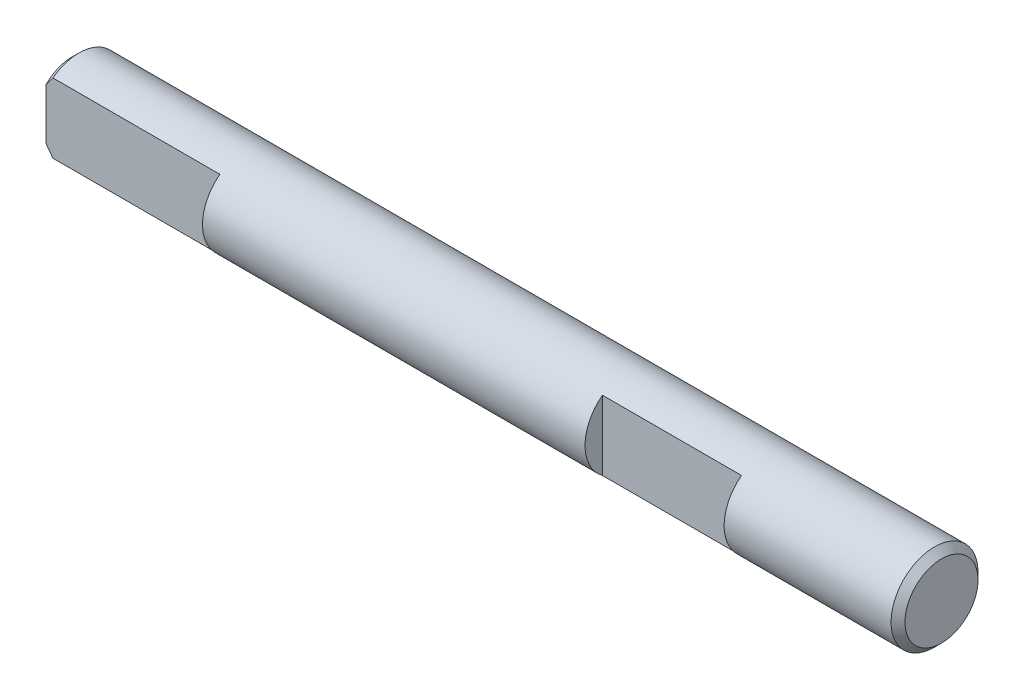
ISO-10303-21;
HEADER;
FILE_DESCRIPTION(('STEP AP214'),'2;1');
FILE_NAME('part.step','',(''),(''),'','','');
FILE_SCHEMA(('AUTOMOTIVE_DESIGN { 1 0 10303 214 1 1 1 1 }'));
ENDSEC;
DATA;
#1=APPLICATION_CONTEXT('core data for automotive mechanical design processes');
#2=APPLICATION_PROTOCOL_DEFINITION('international standard','automotive_design',2000,#1);
#3=PRODUCT_CONTEXT('',#1,'mechanical');
#4=PRODUCT('Part','Part','',(#3));
#5=PRODUCT_RELATED_PRODUCT_CATEGORY('part','',(#4));
#6=PRODUCT_DEFINITION_FORMATION('','',#4);
#7=PRODUCT_DEFINITION_CONTEXT('part definition',#1,'design');
#8=PRODUCT_DEFINITION('design','',#6,#7);
#9=PRODUCT_DEFINITION_SHAPE('','',#8);
#10=(LENGTH_UNIT() NAMED_UNIT(*) SI_UNIT(.MILLI.,.METRE.));
#11=(NAMED_UNIT(*) PLANE_ANGLE_UNIT() SI_UNIT($,.RADIAN.));
#12=(NAMED_UNIT(*) SI_UNIT($,.STERADIAN.) SOLID_ANGLE_UNIT());
#13=UNCERTAINTY_MEASURE_WITH_UNIT(LENGTH_MEASURE(1.E-05),#10,'distance_accuracy_value','');
#14=(GEOMETRIC_REPRESENTATION_CONTEXT(3) GLOBAL_UNCERTAINTY_ASSIGNED_CONTEXT((#13)) GLOBAL_UNIT_ASSIGNED_CONTEXT((#10,
#11,#12)) REPRESENTATION_CONTEXT('',''));
#15=CARTESIAN_POINT('',(0.,0.,0.));
#16=DIRECTION('',(0.,0.,1.));
#17=DIRECTION('',(1.,0.,0.));
#18=AXIS2_PLACEMENT_3D('',#15,#16,#17);
#19=CARTESIAN_POINT('',(-35.499005006743,-29.8491114358384,-79.6629999999964));
#20=DIRECTION('',(0.,0.,-1.));
#21=DIRECTION('',(-1.,0.,0.));
#22=AXIS2_PLACEMENT_3D('',#19,#20,#21);
#23=PLANE('',#22);
#24=CARTESIAN_POINT('',(-37.4990050067429,-28.3794175901685,-79.6629999999963));
#25=CARTESIAN_POINT('',(-37.3295728999299,-28.1373213023221,-79.6629999999964));
#26=CARTESIAN_POINT('',(-37.0990050067429,-27.8491114358384,-79.6629999999964));
#27=(BOUNDED_CURVE() B_SPLINE_CURVE(2,(#24,#25,#26),.UNSPECIFIED.,.F.,
.F.) B_SPLINE_CURVE_WITH_KNOTS((3,3),(0.,0.159512079210779),
.UNSPECIFIED.) CURVE() GEOMETRIC_REPRESENTATION_ITEM() RATIONAL_B_SPLINE_CURVE((1.,
1.05397828201192,1.09610632234515)) REPRESENTATION_ITEM(''));
#28=CARTESIAN_POINT('',(-37.4990050067429,-28.3794175901685,-79.6629999999964));
#29=VERTEX_POINT('',#28);
#30=CARTESIAN_POINT('',(-37.0990050067429,-27.8491114358384,-79.6629999999964));
#31=VERTEX_POINT('',#30);
#32=EDGE_CURVE('E117',#29,#31,#27,.T.);
#33=ORIENTED_EDGE('',*,*,#32,.F.);
#34=DIRECTION('',(0.,1.,0.));
#35=VECTOR('',#34,1.);
#36=CARTESIAN_POINT('',(-37.4990050067429,-29.8491114358384,-79.6629999999964));
#37=LINE('',#36,#35);
#38=CARTESIAN_POINT('',(-37.4990050067429,-31.3188052815083,-79.6629999999964));
#39=VERTEX_POINT('',#38);
#40=EDGE_CURVE('E37',#39,#29,#37,.T.);
#41=ORIENTED_EDGE('',*,*,#40,.F.);
#42=CARTESIAN_POINT('',(-37.0990050067429,-31.8491114358384,-79.6629999999965));
#43=CARTESIAN_POINT('',(-37.3295728999299,-31.5609015693547,-79.6629999999964));
#44=CARTESIAN_POINT('',(-37.4990050067429,-31.3188052815083,-79.6629999999963));
#45=(BOUNDED_CURVE() B_SPLINE_CURVE(2,(#42,#43,#44),.UNSPECIFIED.,.F.,
.F.) B_SPLINE_CURVE_WITH_KNOTS((3,3),(1.29365456994341,1.4531666491542),
.UNSPECIFIED.) CURVE() GEOMETRIC_REPRESENTATION_ITEM() RATIONAL_B_SPLINE_CURVE((1.09610632234512,
1.05397828201191,1.)) REPRESENTATION_ITEM(''));
#46=CARTESIAN_POINT('',(-37.0990050067429,-31.8491114358384,-79.6629999999964));
#47=VERTEX_POINT('',#46);
#48=EDGE_CURVE('E100',#47,#39,#45,.T.);
#49=ORIENTED_EDGE('',*,*,#48,.F.);
#50=DIRECTION('',(-1.,0.,0.));
#51=VECTOR('',#50,1.);
#52=CARTESIAN_POINT('',(10.5010000000472,-31.8491114358384,-79.6629999999964));
#53=LINE('',#52,#51);
#54=CARTESIAN_POINT('',(-27.499005006743,-31.8491114358384,-79.6629999999964));
#55=VERTEX_POINT('',#54);
#56=EDGE_CURVE('E115',#55,#47,#53,.T.);
#57=ORIENTED_EDGE('',*,*,#56,.F.);
#58=DIRECTION('',(0.,1.,0.));
#59=VECTOR('',#58,1.);
#60=CARTESIAN_POINT('',(-27.499005006743,-29.8491114358384,-79.6629999999964));
#61=LINE('',#60,#59);
#62=CARTESIAN_POINT('',(-27.499005006743,-27.8491114358384,-79.6629999999964));
#63=VERTEX_POINT('',#62);
#64=EDGE_CURVE('E11',#55,#63,#61,.T.);
#65=ORIENTED_EDGE('',*,*,#64,.T.);
#66=DIRECTION('',(1.,0.,0.));
#67=VECTOR('',#66,1.);
#68=CARTESIAN_POINT('',(10.5010000000472,-27.8491114358384,-79.6629999999964));
#69=LINE('',#68,#67);
#70=EDGE_CURVE('E151',#31,#63,#69,.T.);
#71=ORIENTED_EDGE('',*,*,#70,.F.);
#72=EDGE_LOOP('',(#33,#41,#49,#57,#65,#71));
#73=FACE_BOUND('',#72,.T.);
#74=ADVANCED_FACE('F16',(#73),#23,.F.);
#75=CARTESIAN_POINT('',(-27.499005006743,-29.8491114358384,-79.6629999999964));
#76=DIRECTION('',(1.,0.,0.));
#77=DIRECTION('',(0.,0.,-1.));
#78=AXIS2_PLACEMENT_3D('',#75,#76,#77);
#79=PLANE('',#78);
#80=CARTESIAN_POINT('',(-27.499005006743,-29.8491114358384,-81.1629999999964));
#81=DIRECTION('',(1.,0.,0.));
#82=DIRECTION('',(0.,1.,0.));
#83=AXIS2_PLACEMENT_3D('',#80,#81,#82);
#84=CIRCLE('',#83,2.5);
#85=EDGE_CURVE('E148',#63,#55,#84,.T.);
#86=ORIENTED_EDGE('',*,*,#85,.F.);
#87=ORIENTED_EDGE('',*,*,#64,.F.);
#88=EDGE_LOOP('',(#86,#87));
#89=FACE_BOUND('',#88,.T.);
#90=ADVANCED_FACE('F199',(#89),#79,.F.);
#91=CARTESIAN_POINT('',(-5.49900029797599,-29.8491114358384,-79.6629999999964));
#92=DIRECTION('',(0.,0.,-1.));
#93=DIRECTION('',(-1.,0.,0.));
#94=AXIS2_PLACEMENT_3D('',#91,#92,#93);
#95=PLANE('',#94);
#96=DIRECTION('',(-1.,0.,0.));
#97=VECTOR('',#96,1.);
#98=CARTESIAN_POINT('',(10.5010000000472,-31.8491114358384,-79.6629999999964));
#99=LINE('',#98,#97);
#100=CARTESIAN_POINT('',(2.5009998212333,-31.8491114358384,-79.6629999999964));
#101=VERTEX_POINT('',#100);
#102=CARTESIAN_POINT('',(-5.49900029797599,-31.8491114358384,-79.6629999999964));
#103=VERTEX_POINT('',#102);
#104=EDGE_CURVE('E104',#101,#103,#99,.T.);
#105=ORIENTED_EDGE('',*,*,#104,.F.);
#106=DIRECTION('',(0.,-1.,0.));
#107=VECTOR('',#106,1.);
#108=CARTESIAN_POINT('',(2.5009998212333,-29.8491114358384,-79.6629999999964));
#109=LINE('',#108,#107);
#110=CARTESIAN_POINT('',(2.5009998212333,-27.8491114358384,-79.6629999999964));
#111=VERTEX_POINT('',#110);
#112=EDGE_CURVE('E26',#111,#101,#109,.T.);
#113=ORIENTED_EDGE('',*,*,#112,.F.);
#114=DIRECTION('',(1.,0.,0.));
#115=VECTOR('',#114,1.);
#116=CARTESIAN_POINT('',(10.5010000000472,-27.8491114358384,-79.6629999999964));
#117=LINE('',#116,#115);
#118=CARTESIAN_POINT('',(-5.49900029797599,-27.8491114358384,-79.6629999999964));
#119=VERTEX_POINT('',#118);
#120=EDGE_CURVE('E95',#119,#111,#117,.T.);
#121=ORIENTED_EDGE('',*,*,#120,.F.);
#122=DIRECTION('',(0.,1.,0.));
#123=VECTOR('',#122,1.);
#124=CARTESIAN_POINT('',(-5.49900029797599,-29.8491114358384,-79.6629999999964));
#125=LINE('',#124,#123);
#126=EDGE_CURVE('E84',#103,#119,#125,.T.);
#127=ORIENTED_EDGE('',*,*,#126,.F.);
#128=EDGE_LOOP('',(#105,#113,#121,#127));
#129=FACE_BOUND('',#128,.T.);
#130=ADVANCED_FACE('F18',(#129),#95,.F.);
#131=CARTESIAN_POINT('',(2.5009998212333,-29.8491114358384,-79.6629999999964));
#132=DIRECTION('',(1.,0.,0.));
#133=DIRECTION('',(0.,0.,-1.));
#134=AXIS2_PLACEMENT_3D('',#131,#132,#133);
#135=PLANE('',#134);
#136=CARTESIAN_POINT('',(2.5009998212333,-29.8491114358384,-81.1629999999964));
#137=DIRECTION('',(1.,0.,0.));
#138=DIRECTION('',(0.,1.,0.));
#139=AXIS2_PLACEMENT_3D('',#136,#137,#138);
#140=CIRCLE('',#139,2.5);
#141=EDGE_CURVE('E111',#111,#101,#140,.T.);
#142=ORIENTED_EDGE('',*,*,#141,.F.);
#143=ORIENTED_EDGE('',*,*,#112,.T.);
#144=EDGE_LOOP('',(#142,#143));
#145=FACE_BOUND('',#144,.T.);
#146=ADVANCED_FACE('F137',(#145),#135,.F.);
#147=CARTESIAN_POINT('',(-5.49900029797599,-29.8491114358384,-67.6629998211824));
#148=DIRECTION('',(-1.,0.,0.));
#149=DIRECTION('',(0.,1.,0.));
#150=AXIS2_PLACEMENT_3D('',#147,#148,#149);
#151=PLANE('',#150);
#152=CARTESIAN_POINT('',(-5.49900029797599,-29.8491114358384,-81.1629999999964));
#153=DIRECTION('',(-1.,0.,0.));
#154=DIRECTION('',(0.,1.,0.));
#155=AXIS2_PLACEMENT_3D('',#152,#153,#154);
#156=CIRCLE('',#155,2.5);
#157=EDGE_CURVE('E88',#103,#119,#156,.T.);
#158=ORIENTED_EDGE('',*,*,#157,.F.);
#159=ORIENTED_EDGE('',*,*,#126,.T.);
#160=EDGE_LOOP('',(#158,#159));
#161=FACE_BOUND('',#160,.T.);
#162=ADVANCED_FACE('F86',(#161),#151,.F.);
#163=CARTESIAN_POINT('',(-37.4990050067429,-29.8491114358384,-81.1629999999964));
#164=DIRECTION('',(1.,0.,0.));
#165=DIRECTION('',(0.,1.,0.));
#166=AXIS2_PLACEMENT_3D('',#163,#164,#165);
#167=PLANE('',#166);
#168=CARTESIAN_POINT('',(-37.4990050067429,-29.8491114358384,-81.1629999999964));
#169=DIRECTION('',(1.,0.,0.));
#170=DIRECTION('',(0.,1.,0.));
#171=AXIS2_PLACEMENT_3D('',#168,#169,#170);
#172=CIRCLE('',#171,2.1);
#173=EDGE_CURVE('E121',#39,#29,#172,.T.);
#174=ORIENTED_EDGE('',*,*,#173,.F.);
#175=ORIENTED_EDGE('',*,*,#40,.T.);
#176=EDGE_LOOP('',(#174,#175));
#177=FACE_BOUND('',#176,.T.);
#178=ADVANCED_FACE('F194',(#177),#167,.F.);
#179=CARTESIAN_POINT('',(-37.2990050067429,-29.8491114358384,-81.1629999999964));
#180=DIRECTION('',(1.,0.,0.));
#181=DIRECTION('',(0.,0.,-1.));
#182=AXIS2_PLACEMENT_3D('',#179,#180,#181);
#183=CONICAL_SURFACE('',#182,2.3,0.785398163397437);
#184=ORIENTED_EDGE('',*,*,#48,.T.);
#185=ORIENTED_EDGE('',*,*,#173,.T.);
#186=ORIENTED_EDGE('',*,*,#32,.T.);
#187=CARTESIAN_POINT('',(-37.0990050067429,-29.8491114358384,-81.1629999999964));
#188=DIRECTION('',(-1.,0.,0.));
#189=DIRECTION('',(0.,1.,0.));
#190=AXIS2_PLACEMENT_3D('',#187,#188,#189);
#191=CIRCLE('',#190,2.5);
#192=CARTESIAN_POINT('',(-37.0990050067429,-32.3491114358384,-81.1629999999964));
#193=VERTEX_POINT('',#192);
#194=EDGE_CURVE('E157',#31,#193,#191,.T.);
#195=ORIENTED_EDGE('',*,*,#194,.T.);
#196=CARTESIAN_POINT('',(-37.0990050067429,-29.8491114358384,-81.1629999999964));
#197=DIRECTION('',(-1.,0.,0.));
#198=DIRECTION('',(0.,1.,0.));
#199=AXIS2_PLACEMENT_3D('',#196,#197,#198);
#200=CIRCLE('',#199,2.5);
#201=EDGE_CURVE('E144',#193,#47,#200,.T.);
#202=ORIENTED_EDGE('',*,*,#201,.T.);
#203=EDGE_LOOP('',(#184,#185,#186,#195,#202));
#204=FACE_BOUND('',#203,.T.);
#205=ADVANCED_FACE('F186',(#204),#183,.T.);
#206=CARTESIAN_POINT('',(12.5009998212333,-29.8491114358384,-81.1629999999964));
#207=DIRECTION('',(1.,0.,0.));
#208=DIRECTION('',(0.,1.,0.));
#209=AXIS2_PLACEMENT_3D('',#206,#207,#208);
#210=PLANE('',#209);
#211=CARTESIAN_POINT('',(12.5009998212333,-29.8491114358384,-81.1629999999964));
#212=DIRECTION('',(-1.,0.,0.));
#213=DIRECTION('',(0.,1.,0.));
#214=AXIS2_PLACEMENT_3D('',#211,#212,#213);
#215=CIRCLE('',#214,2.1);
#216=CARTESIAN_POINT('',(12.5009998212333,-31.9491114358384,-81.1629999999964));
#217=VERTEX_POINT('',#216);
#218=EDGE_CURVE('E173',#217,#217,#215,.T.);
#219=ORIENTED_EDGE('',*,*,#218,.F.);
#220=EDGE_LOOP('',(#219));
#221=FACE_BOUND('',#220,.T.);
#222=ADVANCED_FACE('F184',(#221),#210,.T.);
#223=CARTESIAN_POINT('',(10.5010000000472,-29.8491114358384,-81.1629999999964));
#224=DIRECTION('',(-1.,0.,0.));
#225=DIRECTION('',(0.,1.,0.));
#226=AXIS2_PLACEMENT_3D('',#223,#224,#225);
#227=CYLINDRICAL_SURFACE('',#226,2.5);
#228=ORIENTED_EDGE('',*,*,#141,.T.);
#229=ORIENTED_EDGE('',*,*,#104,.T.);
#230=ORIENTED_EDGE('',*,*,#157,.T.);
#231=ORIENTED_EDGE('',*,*,#120,.T.);
#232=EDGE_LOOP('',(#228,#229,#230,#231));
#233=FACE_BOUND('',#232,.T.);
#234=ORIENTED_EDGE('',*,*,#194,.F.);
#235=ORIENTED_EDGE('',*,*,#70,.T.);
#236=ORIENTED_EDGE('',*,*,#85,.T.);
#237=ORIENTED_EDGE('',*,*,#56,.T.);
#238=ORIENTED_EDGE('',*,*,#201,.F.);
#239=DIRECTION('',(1.,0.,0.));
#240=VECTOR('',#239,1.);
#241=CARTESIAN_POINT('',(10.5010000000472,-32.3491114358384,-81.1629999999964));
#242=LINE('',#241,#240);
#243=CARTESIAN_POINT('',(12.1009998212333,-32.3491114358384,-81.1629999999964));
#244=VERTEX_POINT('',#243);
#245=EDGE_CURVE('E139',#193,#244,#242,.T.);
#246=ORIENTED_EDGE('',*,*,#245,.T.);
#247=CARTESIAN_POINT('',(12.1009998212333,-29.8491114358384,-81.1629999999964));
#248=DIRECTION('',(1.,0.,0.));
#249=DIRECTION('',(0.,1.,0.));
#250=AXIS2_PLACEMENT_3D('',#247,#248,#249);
#251=CIRCLE('',#250,2.5);
#252=EDGE_CURVE('E163',#244,#244,#251,.T.);
#253=ORIENTED_EDGE('',*,*,#252,.F.);
#254=ORIENTED_EDGE('',*,*,#245,.F.);
#255=EDGE_LOOP('',(#234,#235,#236,#237,#238,#246,#253,#254));
#256=FACE_BOUND('',#255,.T.);
#257=ADVANCED_FACE('F102',(#233,#256),#227,.T.);
#258=CARTESIAN_POINT('',(12.3009998212333,-29.8491114358384,-81.1629999999964));
#259=DIRECTION('',(-1.,0.,0.));
#260=DIRECTION('',(0.,1.,0.));
#261=AXIS2_PLACEMENT_3D('',#258,#259,#260);
#262=CONICAL_SURFACE('',#261,2.3,0.785398163397448);
#263=ORIENTED_EDGE('',*,*,#218,.T.);
#264=DIRECTION('',(-0.707106781186548,-0.707106781186548,0.));
#265=VECTOR('',#264,1.);
#266=CARTESIAN_POINT('',(12.3009998212333,-32.1491114358384,-81.1629999999964));
#267=LINE('',#266,#265);
#268=EDGE_CURVE('E168',#217,#244,#267,.T.);
#269=ORIENTED_EDGE('',*,*,#268,.T.);
#270=ORIENTED_EDGE('',*,*,#252,.T.);
#271=ORIENTED_EDGE('',*,*,#268,.F.);
#272=EDGE_LOOP('',(#263,#269,#270,#271));
#273=FACE_BOUND('',#272,.T.);
#274=ADVANCED_FACE('F182',(#273),#262,.T.);
#275=CLOSED_SHELL('',(#74,#90,#130,#146,#162,#178,#205,#222,#257,#274));
#276=MANIFOLD_SOLID_BREP('B1',#275);
#277=ADVANCED_BREP_SHAPE_REPRESENTATION('',(#18,#276),#14);
#278=SHAPE_DEFINITION_REPRESENTATION(#9,#277);
ENDSEC;
END-ISO-10303-21;
